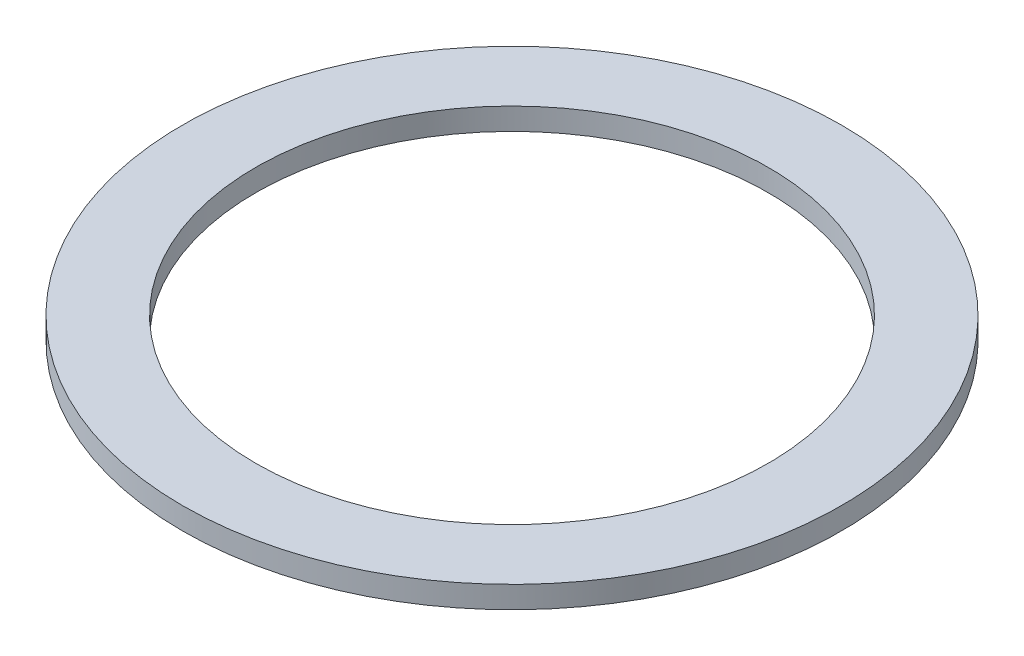
ISO-10303-21;
HEADER;
FILE_DESCRIPTION(('STEP AP214'),'2;1');
FILE_NAME('part.step','',(''),(''),'','','');
FILE_SCHEMA(('AUTOMOTIVE_DESIGN { 1 0 10303 214 1 1 1 1 }'));
ENDSEC;
DATA;
#1=APPLICATION_CONTEXT('core data for automotive mechanical design processes');
#2=APPLICATION_PROTOCOL_DEFINITION('international standard','automotive_design',2000,#1);
#3=PRODUCT_CONTEXT('',#1,'mechanical');
#4=PRODUCT('Part','Part','',(#3));
#5=PRODUCT_RELATED_PRODUCT_CATEGORY('part','',(#4));
#6=PRODUCT_DEFINITION_FORMATION('','',#4);
#7=PRODUCT_DEFINITION_CONTEXT('part definition',#1,'design');
#8=PRODUCT_DEFINITION('design','',#6,#7);
#9=PRODUCT_DEFINITION_SHAPE('','',#8);
#10=(LENGTH_UNIT() NAMED_UNIT(*) SI_UNIT(.MILLI.,.METRE.));
#11=(NAMED_UNIT(*) PLANE_ANGLE_UNIT() SI_UNIT($,.RADIAN.));
#12=(NAMED_UNIT(*) SI_UNIT($,.STERADIAN.) SOLID_ANGLE_UNIT());
#13=UNCERTAINTY_MEASURE_WITH_UNIT(LENGTH_MEASURE(1.E-05),#10,'distance_accuracy_value','');
#14=(GEOMETRIC_REPRESENTATION_CONTEXT(3) GLOBAL_UNCERTAINTY_ASSIGNED_CONTEXT((#13)) GLOBAL_UNIT_ASSIGNED_CONTEXT((#10,
#11,#12)) REPRESENTATION_CONTEXT('',''));
#15=CARTESIAN_POINT('',(0.,0.,0.));
#16=DIRECTION('',(0.,0.,1.));
#17=DIRECTION('',(1.,0.,0.));
#18=AXIS2_PLACEMENT_3D('',#15,#16,#17);
#19=CARTESIAN_POINT('',(0.,3.,0.));
#20=DIRECTION('',(0.,1.,0.));
#21=DIRECTION('',(0.,0.,1.));
#22=AXIS2_PLACEMENT_3D('',#19,#20,#21);
#23=PLANE('',#22);
#24=CARTESIAN_POINT('',(0.,3.,0.));
#25=DIRECTION('',(0.,1.,0.));
#26=DIRECTION('',(0.,0.,1.));
#27=AXIS2_PLACEMENT_3D('',#24,#25,#26);
#28=CIRCLE('',#27,45.);
#29=CARTESIAN_POINT('',(0.,3.,45.));
#30=VERTEX_POINT('',#29);
#31=EDGE_CURVE('E10',#30,#30,#28,.T.);
#32=ORIENTED_EDGE('',*,*,#31,.T.);
#33=EDGE_LOOP('',(#32));
#34=FACE_BOUND('',#33,.T.);
#35=CARTESIAN_POINT('',(0.,3.,0.));
#36=DIRECTION('',(0.,1.,0.));
#37=DIRECTION('',(0.,0.,1.));
#38=AXIS2_PLACEMENT_3D('',#35,#36,#37);
#39=CIRCLE('',#38,35.);
#40=CARTESIAN_POINT('',(0.,3.,35.));
#41=VERTEX_POINT('',#40);
#42=EDGE_CURVE('E43',#41,#41,#39,.T.);
#43=ORIENTED_EDGE('',*,*,#42,.F.);
#44=EDGE_LOOP('',(#43));
#45=FACE_BOUND('',#44,.T.);
#46=ADVANCED_FACE('F32',(#34,#45),#23,.T.);
#47=CARTESIAN_POINT('',(0.,0.,0.));
#48=DIRECTION('',(0.,1.,0.));
#49=DIRECTION('',(0.,0.,1.));
#50=AXIS2_PLACEMENT_3D('',#47,#48,#49);
#51=PLANE('',#50);
#52=CARTESIAN_POINT('',(0.,0.,0.));
#53=DIRECTION('',(0.,1.,0.));
#54=DIRECTION('',(0.,0.,1.));
#55=AXIS2_PLACEMENT_3D('',#52,#53,#54);
#56=CIRCLE('',#55,45.);
#57=CARTESIAN_POINT('',(0.,0.,45.));
#58=VERTEX_POINT('',#57);
#59=EDGE_CURVE('E36',#58,#58,#56,.T.);
#60=ORIENTED_EDGE('',*,*,#59,.F.);
#61=EDGE_LOOP('',(#60));
#62=FACE_BOUND('',#61,.T.);
#63=CARTESIAN_POINT('',(0.,0.,0.));
#64=DIRECTION('',(0.,1.,0.));
#65=DIRECTION('',(0.,0.,1.));
#66=AXIS2_PLACEMENT_3D('',#63,#64,#65);
#67=CIRCLE('',#66,35.);
#68=CARTESIAN_POINT('',(0.,0.,35.));
#69=VERTEX_POINT('',#68);
#70=EDGE_CURVE('E45',#69,#69,#67,.T.);
#71=ORIENTED_EDGE('',*,*,#70,.T.);
#72=EDGE_LOOP('',(#71));
#73=FACE_BOUND('',#72,.T.);
#74=ADVANCED_FACE('F55',(#62,#73),#51,.F.);
#75=CARTESIAN_POINT('',(0.,3.,0.));
#76=DIRECTION('',(0.,-1.,0.));
#77=DIRECTION('',(0.,0.,-1.));
#78=AXIS2_PLACEMENT_3D('',#75,#76,#77);
#79=CYLINDRICAL_SURFACE('',#78,45.);
#80=ORIENTED_EDGE('',*,*,#31,.F.);
#81=EDGE_LOOP('',(#80));
#82=FACE_BOUND('',#81,.T.);
#83=ORIENTED_EDGE('',*,*,#59,.T.);
#84=EDGE_LOOP('',(#83));
#85=FACE_BOUND('',#84,.T.);
#86=ADVANCED_FACE('F34',(#82,#85),#79,.T.);
#87=CARTESIAN_POINT('',(0.,3.,0.));
#88=DIRECTION('',(0.,-1.,0.));
#89=DIRECTION('',(0.,0.,-1.));
#90=AXIS2_PLACEMENT_3D('',#87,#88,#89);
#91=CYLINDRICAL_SURFACE('',#90,35.);
#92=ORIENTED_EDGE('',*,*,#42,.T.);
#93=EDGE_LOOP('',(#92));
#94=FACE_BOUND('',#93,.T.);
#95=ORIENTED_EDGE('',*,*,#70,.F.);
#96=EDGE_LOOP('',(#95));
#97=FACE_BOUND('',#96,.T.);
#98=ADVANCED_FACE('F51',(#94,#97),#91,.F.);
#99=CLOSED_SHELL('',(#46,#74,#86,#98));
#100=MANIFOLD_SOLID_BREP('B2',#99);
#101=ADVANCED_BREP_SHAPE_REPRESENTATION('',(#18,#100),#14);
#102=SHAPE_DEFINITION_REPRESENTATION(#9,#101);
ENDSEC;
END-ISO-10303-21;
